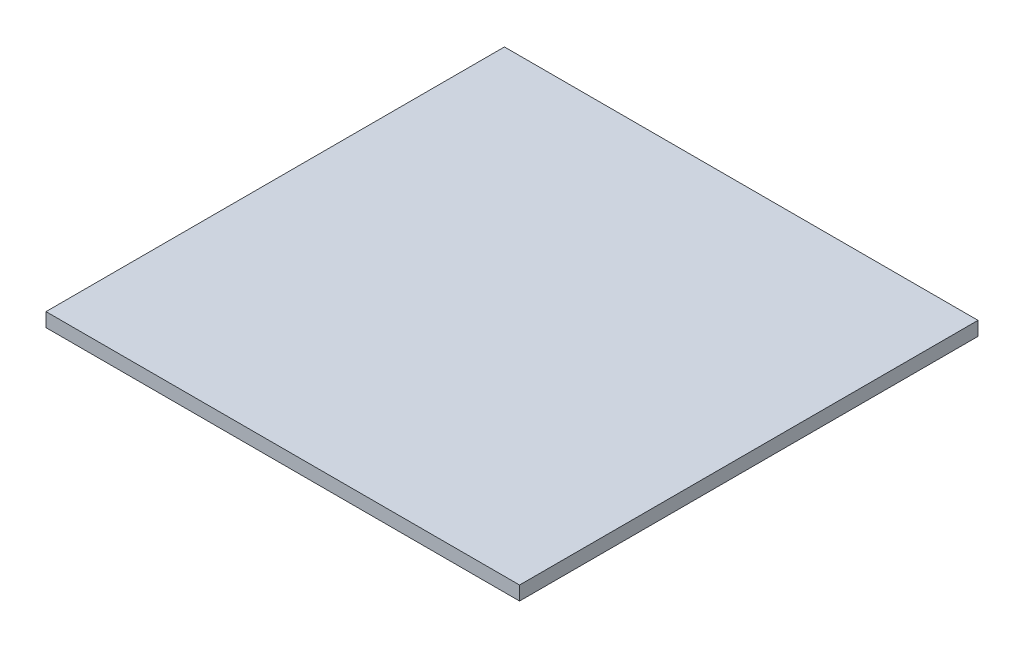
ISO-10303-21;
HEADER;
FILE_DESCRIPTION(('STEP AP214'),'2;1');
FILE_NAME('part.step','',(''),(''),'','','');
FILE_SCHEMA(('AUTOMOTIVE_DESIGN { 1 0 10303 214 1 1 1 1 }'));
ENDSEC;
DATA;
#1=APPLICATION_CONTEXT('core data for automotive mechanical design processes');
#2=APPLICATION_PROTOCOL_DEFINITION('international standard','automotive_design',2000,#1);
#3=PRODUCT_CONTEXT('',#1,'mechanical');
#4=PRODUCT('Part','Part','',(#3));
#5=PRODUCT_RELATED_PRODUCT_CATEGORY('part','',(#4));
#6=PRODUCT_DEFINITION_FORMATION('','',#4);
#7=PRODUCT_DEFINITION_CONTEXT('part definition',#1,'design');
#8=PRODUCT_DEFINITION('design','',#6,#7);
#9=PRODUCT_DEFINITION_SHAPE('','',#8);
#10=(LENGTH_UNIT() NAMED_UNIT(*) SI_UNIT(.MILLI.,.METRE.));
#11=(NAMED_UNIT(*) PLANE_ANGLE_UNIT() SI_UNIT($,.RADIAN.));
#12=(NAMED_UNIT(*) SI_UNIT($,.STERADIAN.) SOLID_ANGLE_UNIT());
#13=UNCERTAINTY_MEASURE_WITH_UNIT(LENGTH_MEASURE(1.E-05),#10,'distance_accuracy_value','');
#14=(GEOMETRIC_REPRESENTATION_CONTEXT(3) GLOBAL_UNCERTAINTY_ASSIGNED_CONTEXT((#13)) GLOBAL_UNIT_ASSIGNED_CONTEXT((#10,
#11,#12)) REPRESENTATION_CONTEXT('',''));
#15=CARTESIAN_POINT('',(0.,0.,0.));
#16=DIRECTION('',(0.,0.,1.));
#17=DIRECTION('',(1.,0.,0.));
#18=AXIS2_PLACEMENT_3D('',#15,#16,#17);
#19=CARTESIAN_POINT('',(-44.2815420560747,3.,-20.6980140186916));
#20=DIRECTION('',(1.,0.,0.));
#21=DIRECTION('',(0.,0.,-1.));
#22=AXIS2_PLACEMENT_3D('',#19,#20,#21);
#23=PLANE('',#22);
#24=DIRECTION('',(0.,0.,1.));
#25=VECTOR('',#24,1.);
#26=CARTESIAN_POINT('',(-44.2815420560747,0.,-20.6980140186916));
#27=LINE('',#26,#25);
#28=CARTESIAN_POINT('',(-44.2815420560747,0.,-20.6980140186916));
#29=VERTEX_POINT('',#28);
#30=CARTESIAN_POINT('',(-44.2815420560747,0.,78.1019859813084));
#31=VERTEX_POINT('',#30);
#32=EDGE_CURVE('E96',#29,#31,#27,.T.);
#33=ORIENTED_EDGE('',*,*,#32,.T.);
#34=DIRECTION('',(0.,-1.,0.));
#35=VECTOR('',#34,1.);
#36=CARTESIAN_POINT('',(-44.2815420560747,3.,78.1019859813084));
#37=LINE('',#36,#35);
#38=CARTESIAN_POINT('',(-44.2815420560747,3.,78.1019859813084));
#39=VERTEX_POINT('',#38);
#40=EDGE_CURVE('E11',#39,#31,#37,.T.);
#41=ORIENTED_EDGE('',*,*,#40,.F.);
#42=DIRECTION('',(0.,0.,1.));
#43=VECTOR('',#42,1.);
#44=CARTESIAN_POINT('',(-44.2815420560747,3.,-20.6980140186916));
#45=LINE('',#44,#43);
#46=CARTESIAN_POINT('',(-44.2815420560747,3.,-20.6980140186916));
#47=VERTEX_POINT('',#46);
#48=EDGE_CURVE('E84',#47,#39,#45,.T.);
#49=ORIENTED_EDGE('',*,*,#48,.F.);
#50=DIRECTION('',(0.,-1.,0.));
#51=VECTOR('',#50,1.);
#52=CARTESIAN_POINT('',(-44.2815420560747,3.,-20.6980140186916));
#53=LINE('',#52,#51);
#54=EDGE_CURVE('E92',#47,#29,#53,.T.);
#55=ORIENTED_EDGE('',*,*,#54,.T.);
#56=EDGE_LOOP('',(#33,#41,#49,#55));
#57=FACE_BOUND('',#56,.T.);
#58=ADVANCED_FACE('F33',(#57),#23,.F.);
#59=CARTESIAN_POINT('',(-44.2815420560747,3.,78.1019859813084));
#60=DIRECTION('',(0.,0.,-1.));
#61=DIRECTION('',(-1.,0.,0.));
#62=AXIS2_PLACEMENT_3D('',#59,#60,#61);
#63=PLANE('',#62);
#64=DIRECTION('',(1.,0.,0.));
#65=VECTOR('',#64,1.);
#66=CARTESIAN_POINT('',(-44.2815420560747,0.,78.1019859813084));
#67=LINE('',#66,#65);
#68=CARTESIAN_POINT('',(57.7784579439253,0.,78.1019859813084));
#69=VERTEX_POINT('',#68);
#70=EDGE_CURVE('E88',#31,#69,#67,.T.);
#71=ORIENTED_EDGE('',*,*,#70,.T.);
#72=DIRECTION('',(0.,-1.,0.));
#73=VECTOR('',#72,1.);
#74=CARTESIAN_POINT('',(57.7784579439253,3.,78.1019859813084));
#75=LINE('',#74,#73);
#76=CARTESIAN_POINT('',(57.7784579439253,3.,78.1019859813084));
#77=VERTEX_POINT('',#76);
#78=EDGE_CURVE('E41',#77,#69,#75,.T.);
#79=ORIENTED_EDGE('',*,*,#78,.F.);
#80=DIRECTION('',(1.,0.,0.));
#81=VECTOR('',#80,1.);
#82=CARTESIAN_POINT('',(-44.2815420560747,3.,78.1019859813084));
#83=LINE('',#82,#81);
#84=EDGE_CURVE('E79',#39,#77,#83,.T.);
#85=ORIENTED_EDGE('',*,*,#84,.F.);
#86=ORIENTED_EDGE('',*,*,#40,.T.);
#87=EDGE_LOOP('',(#71,#79,#85,#86));
#88=FACE_BOUND('',#87,.T.);
#89=ADVANCED_FACE('F87',(#88),#63,.F.);
#90=CARTESIAN_POINT('',(57.7784579439252,3.,-20.6980140186916));
#91=DIRECTION('',(-1.,0.,0.));
#92=DIRECTION('',(0.,0.,1.));
#93=AXIS2_PLACEMENT_3D('',#90,#91,#92);
#94=PLANE('',#93);
#95=DIRECTION('',(0.,0.,-1.));
#96=VECTOR('',#95,1.);
#97=CARTESIAN_POINT('',(57.7784579439252,0.,-20.6980140186916));
#98=LINE('',#97,#96);
#99=CARTESIAN_POINT('',(57.7784579439252,0.,-20.6980140186916));
#100=VERTEX_POINT('',#99);
#101=EDGE_CURVE('E66',#69,#100,#98,.T.);
#102=ORIENTED_EDGE('',*,*,#101,.T.);
#103=DIRECTION('',(0.,-1.,0.));
#104=VECTOR('',#103,1.);
#105=CARTESIAN_POINT('',(57.7784579439252,3.,-20.6980140186916));
#106=LINE('',#105,#104);
#107=CARTESIAN_POINT('',(57.7784579439252,3.,-20.6980140186916));
#108=VERTEX_POINT('',#107);
#109=EDGE_CURVE('E89',#108,#100,#106,.T.);
#110=ORIENTED_EDGE('',*,*,#109,.F.);
#111=DIRECTION('',(0.,0.,-1.));
#112=VECTOR('',#111,1.);
#113=CARTESIAN_POINT('',(57.7784579439252,3.,-20.6980140186916));
#114=LINE('',#113,#112);
#115=EDGE_CURVE('E82',#77,#108,#114,.T.);
#116=ORIENTED_EDGE('',*,*,#115,.F.);
#117=ORIENTED_EDGE('',*,*,#78,.T.);
#118=EDGE_LOOP('',(#102,#110,#116,#117));
#119=FACE_BOUND('',#118,.T.);
#120=ADVANCED_FACE('F90',(#119),#94,.F.);
#121=CARTESIAN_POINT('',(-44.2815420560747,3.,-20.6980140186916));
#122=DIRECTION('',(0.,0.,1.));
#123=DIRECTION('',(1.,0.,0.));
#124=AXIS2_PLACEMENT_3D('',#121,#122,#123);
#125=PLANE('',#124);
#126=DIRECTION('',(-1.,0.,0.));
#127=VECTOR('',#126,1.);
#128=CARTESIAN_POINT('',(-44.2815420560747,0.,-20.6980140186916));
#129=LINE('',#128,#127);
#130=EDGE_CURVE('E72',#100,#29,#129,.T.);
#131=ORIENTED_EDGE('',*,*,#130,.T.);
#132=ORIENTED_EDGE('',*,*,#54,.F.);
#133=DIRECTION('',(-1.,0.,0.));
#134=VECTOR('',#133,1.);
#135=CARTESIAN_POINT('',(-44.2815420560747,3.,-20.6980140186916));
#136=LINE('',#135,#134);
#137=EDGE_CURVE('E49',#108,#47,#136,.T.);
#138=ORIENTED_EDGE('',*,*,#137,.F.);
#139=ORIENTED_EDGE('',*,*,#109,.T.);
#140=EDGE_LOOP('',(#131,#132,#138,#139));
#141=FACE_BOUND('',#140,.T.);
#142=ADVANCED_FACE('F103',(#141),#125,.F.);
#143=CARTESIAN_POINT('',(0.,3.,0.));
#144=DIRECTION('',(0.,1.,0.));
#145=DIRECTION('',(0.,0.,1.));
#146=AXIS2_PLACEMENT_3D('',#143,#144,#145);
#147=PLANE('',#146);
#148=ORIENTED_EDGE('',*,*,#48,.T.);
#149=ORIENTED_EDGE('',*,*,#84,.T.);
#150=ORIENTED_EDGE('',*,*,#115,.T.);
#151=ORIENTED_EDGE('',*,*,#137,.T.);
#152=EDGE_LOOP('',(#148,#149,#150,#151));
#153=FACE_BOUND('',#152,.T.);
#154=ADVANCED_FACE('F80',(#153),#147,.T.);
#155=CARTESIAN_POINT('',(0.,0.,0.));
#156=DIRECTION('',(0.,1.,0.));
#157=DIRECTION('',(0.,0.,1.));
#158=AXIS2_PLACEMENT_3D('',#155,#156,#157);
#159=PLANE('',#158);
#160=ORIENTED_EDGE('',*,*,#32,.F.);
#161=ORIENTED_EDGE('',*,*,#130,.F.);
#162=ORIENTED_EDGE('',*,*,#101,.F.);
#163=ORIENTED_EDGE('',*,*,#70,.F.);
#164=EDGE_LOOP('',(#160,#161,#162,#163));
#165=FACE_BOUND('',#164,.T.);
#166=ADVANCED_FACE('F106',(#165),#159,.F.);
#167=CLOSED_SHELL('',(#58,#89,#120,#142,#154,#166));
#168=MANIFOLD_SOLID_BREP('B2',#167);
#169=ADVANCED_BREP_SHAPE_REPRESENTATION('',(#18,#168),#14);
#170=SHAPE_DEFINITION_REPRESENTATION(#9,#169);
ENDSEC;
END-ISO-10303-21;
